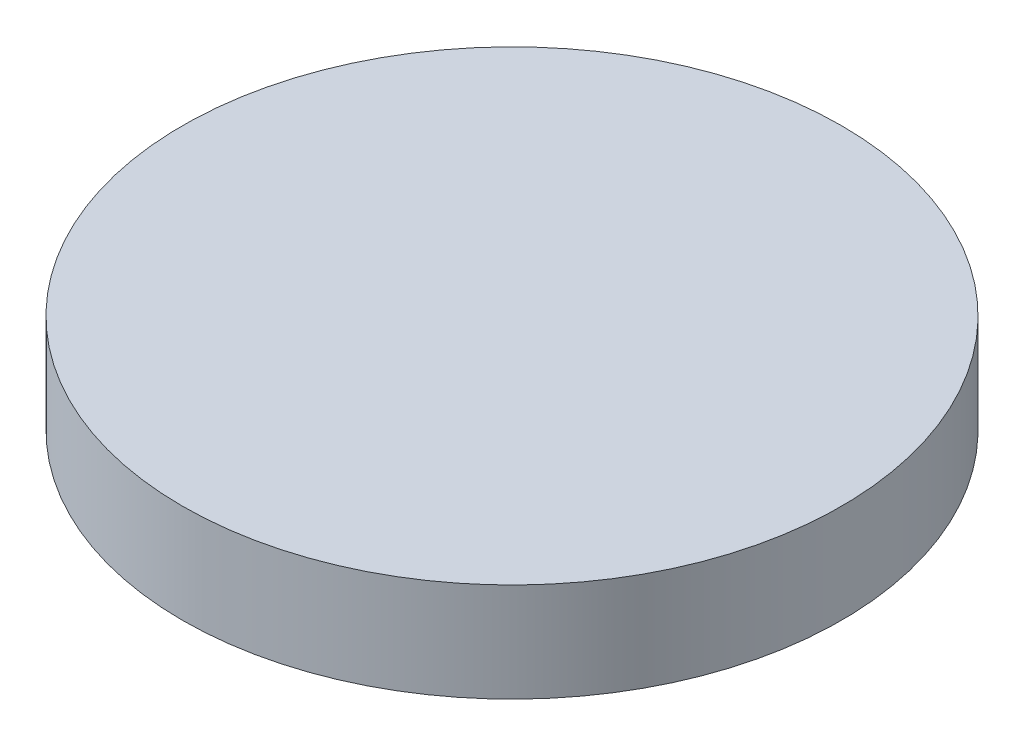
ISO-10303-21;
HEADER;
FILE_DESCRIPTION(('STEP AP214'),'2;1');
FILE_NAME('part.step','',(''),(''),'','','');
FILE_SCHEMA(('AUTOMOTIVE_DESIGN { 1 0 10303 214 1 1 1 1 }'));
ENDSEC;
DATA;
#1=APPLICATION_CONTEXT('core data for automotive mechanical design processes');
#2=APPLICATION_PROTOCOL_DEFINITION('international standard','automotive_design',2000,#1);
#3=PRODUCT_CONTEXT('',#1,'mechanical');
#4=PRODUCT('Part','Part','',(#3));
#5=PRODUCT_RELATED_PRODUCT_CATEGORY('part','',(#4));
#6=PRODUCT_DEFINITION_FORMATION('','',#4);
#7=PRODUCT_DEFINITION_CONTEXT('part definition',#1,'design');
#8=PRODUCT_DEFINITION('design','',#6,#7);
#9=PRODUCT_DEFINITION_SHAPE('','',#8);
#10=(LENGTH_UNIT() NAMED_UNIT(*) SI_UNIT(.MILLI.,.METRE.));
#11=(NAMED_UNIT(*) PLANE_ANGLE_UNIT() SI_UNIT($,.RADIAN.));
#12=(NAMED_UNIT(*) SI_UNIT($,.STERADIAN.) SOLID_ANGLE_UNIT());
#13=UNCERTAINTY_MEASURE_WITH_UNIT(LENGTH_MEASURE(1.E-05),#10,'distance_accuracy_value','');
#14=(GEOMETRIC_REPRESENTATION_CONTEXT(3) GLOBAL_UNCERTAINTY_ASSIGNED_CONTEXT((#13)) GLOBAL_UNIT_ASSIGNED_CONTEXT((#10,
#11,#12)) REPRESENTATION_CONTEXT('',''));
#15=CARTESIAN_POINT('',(0.,0.,0.));
#16=DIRECTION('',(0.,0.,1.));
#17=DIRECTION('',(1.,0.,0.));
#18=AXIS2_PLACEMENT_3D('',#15,#16,#17);
#19=CARTESIAN_POINT('',(0.,0.,0.));
#20=DIRECTION('',(0.,1.,0.));
#21=DIRECTION('',(0.,0.,1.));
#22=AXIS2_PLACEMENT_3D('',#19,#20,#21);
#23=PLANE('',#22);
#24=CARTESIAN_POINT('',(0.,0.,0.));
#25=DIRECTION('',(0.,1.,0.));
#26=DIRECTION('',(0.,0.,1.));
#27=AXIS2_PLACEMENT_3D('',#24,#25,#26);
#28=CIRCLE('',#27,5.);
#29=CARTESIAN_POINT('',(0.,0.,5.));
#30=VERTEX_POINT('',#29);
#31=EDGE_CURVE('E41',#30,#30,#28,.T.);
#32=ORIENTED_EDGE('',*,*,#31,.F.);
#33=EDGE_LOOP('',(#32));
#34=FACE_BOUND('',#33,.T.);
#35=CARTESIAN_POINT('',(0.,0.,0.));
#36=DIRECTION('',(0.,1.,0.));
#37=DIRECTION('',(0.,0.,1.));
#38=AXIS2_PLACEMENT_3D('',#35,#36,#37);
#39=CIRCLE('',#38,4.5);
#40=CARTESIAN_POINT('',(0.,0.,4.5));
#41=VERTEX_POINT('',#40);
#42=EDGE_CURVE('E10',#41,#41,#39,.F.);
#43=ORIENTED_EDGE('',*,*,#42,.F.);
#44=EDGE_LOOP('',(#43));
#45=FACE_BOUND('',#44,.T.);
#46=ADVANCED_FACE('F30',(#34,#45),#23,.F.);
#47=CARTESIAN_POINT('',(0.,1.5,0.));
#48=DIRECTION('',(0.,-1.,0.));
#49=DIRECTION('',(0.,0.,-1.));
#50=AXIS2_PLACEMENT_3D('',#47,#48,#49);
#51=CYLINDRICAL_SURFACE('',#50,5.);
#52=CARTESIAN_POINT('',(0.,1.5,0.));
#53=DIRECTION('',(0.,1.,0.));
#54=DIRECTION('',(0.,0.,1.));
#55=AXIS2_PLACEMENT_3D('',#52,#53,#54);
#56=CIRCLE('',#55,5.);
#57=CARTESIAN_POINT('',(0.,1.5,5.));
#58=VERTEX_POINT('',#57);
#59=EDGE_CURVE('E37',#58,#58,#56,.T.);
#60=ORIENTED_EDGE('',*,*,#59,.F.);
#61=EDGE_LOOP('',(#60));
#62=FACE_BOUND('',#61,.T.);
#63=ORIENTED_EDGE('',*,*,#31,.T.);
#64=EDGE_LOOP('',(#63));
#65=FACE_BOUND('',#64,.T.);
#66=ADVANCED_FACE('F32',(#62,#65),#51,.T.);
#67=CARTESIAN_POINT('',(0.,1.5,0.));
#68=DIRECTION('',(0.,1.,0.));
#69=DIRECTION('',(0.,0.,1.));
#70=AXIS2_PLACEMENT_3D('',#67,#68,#69);
#71=PLANE('',#70);
#72=ORIENTED_EDGE('',*,*,#59,.T.);
#73=EDGE_LOOP('',(#72));
#74=FACE_BOUND('',#73,.T.);
#75=ADVANCED_FACE('F55',(#74),#71,.T.);
#76=CARTESIAN_POINT('',(0.,-0.1,0.));
#77=DIRECTION('',(0.,1.,0.));
#78=DIRECTION('',(0.,0.,1.));
#79=AXIS2_PLACEMENT_3D('',#76,#77,#78);
#80=CYLINDRICAL_SURFACE('',#79,4.5);
#81=CARTESIAN_POINT('',(0.,-0.1,0.));
#82=DIRECTION('',(0.,-1.,0.));
#83=DIRECTION('',(0.,0.,-1.));
#84=AXIS2_PLACEMENT_3D('',#81,#82,#83);
#85=CIRCLE('',#84,4.5);
#86=CARTESIAN_POINT('',(0.,-0.1,-4.5));
#87=VERTEX_POINT('',#86);
#88=EDGE_CURVE('E46',#87,#87,#85,.T.);
#89=ORIENTED_EDGE('',*,*,#88,.F.);
#90=EDGE_LOOP('',(#89));
#91=FACE_BOUND('',#90,.T.);
#92=ORIENTED_EDGE('',*,*,#42,.T.);
#93=EDGE_LOOP('',(#92));
#94=FACE_BOUND('',#93,.T.);
#95=ADVANCED_FACE('F53',(#91,#94),#80,.T.);
#96=CARTESIAN_POINT('',(0.,-0.1,0.));
#97=DIRECTION('',(0.,-1.,0.));
#98=DIRECTION('',(0.,0.,-1.));
#99=AXIS2_PLACEMENT_3D('',#96,#97,#98);
#100=PLANE('',#99);
#101=ORIENTED_EDGE('',*,*,#88,.T.);
#102=EDGE_LOOP('',(#101));
#103=FACE_BOUND('',#102,.T.);
#104=ADVANCED_FACE('F51',(#103),#100,.T.);
#105=CLOSED_SHELL('',(#46,#66,#75,#95,#104));
#106=MANIFOLD_SOLID_BREP('B2',#105);
#107=ADVANCED_BREP_SHAPE_REPRESENTATION('',(#18,#106),#14);
#108=SHAPE_DEFINITION_REPRESENTATION(#9,#107);
ENDSEC;
END-ISO-10303-21;
